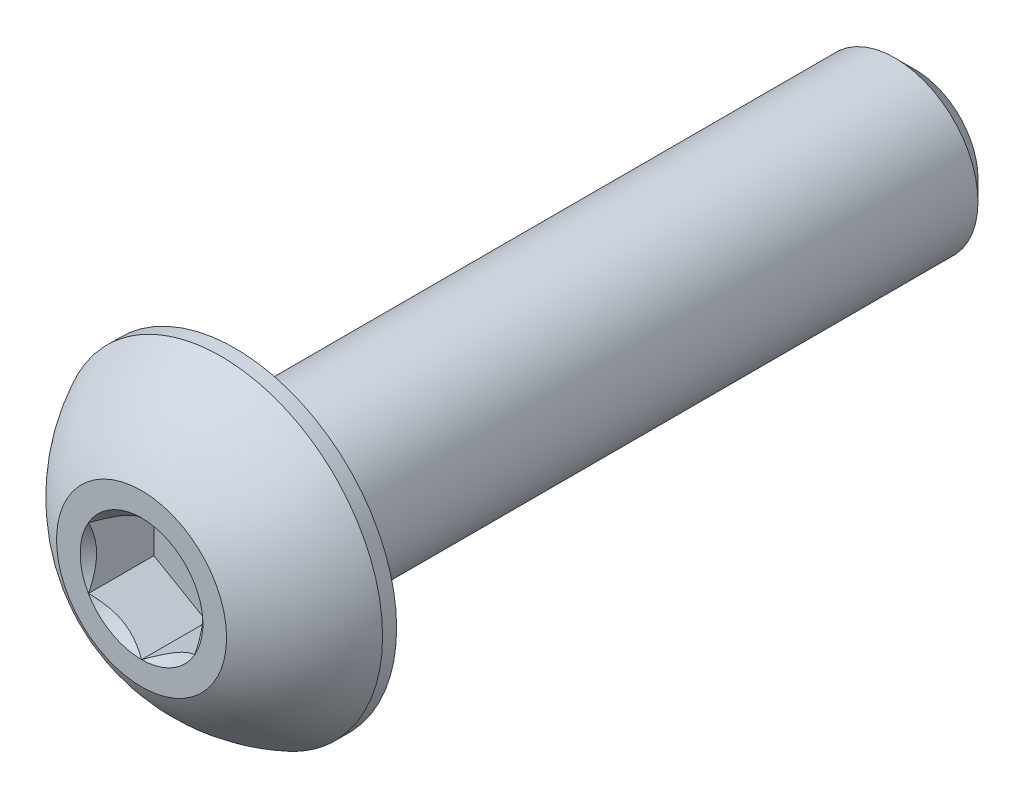
ISO-10303-21;
HEADER;
FILE_DESCRIPTION(('STEP AP214'),'2;1');
FILE_NAME('part.step','',(''),(''),'','','');
FILE_SCHEMA(('AUTOMOTIVE_DESIGN { 1 0 10303 214 1 1 1 1 }'));
ENDSEC;
DATA;
#1=APPLICATION_CONTEXT('core data for automotive mechanical design processes');
#2=APPLICATION_PROTOCOL_DEFINITION('international standard','automotive_design',2000,#1);
#3=PRODUCT_CONTEXT('',#1,'mechanical');
#4=PRODUCT('Part','Part','',(#3));
#5=PRODUCT_RELATED_PRODUCT_CATEGORY('part','',(#4));
#6=PRODUCT_DEFINITION_FORMATION('','',#4);
#7=PRODUCT_DEFINITION_CONTEXT('part definition',#1,'design');
#8=PRODUCT_DEFINITION('design','',#6,#7);
#9=PRODUCT_DEFINITION_SHAPE('','',#8);
#10=(LENGTH_UNIT() NAMED_UNIT(*) SI_UNIT(.MILLI.,.METRE.));
#11=(NAMED_UNIT(*) PLANE_ANGLE_UNIT() SI_UNIT($,.RADIAN.));
#12=(NAMED_UNIT(*) SI_UNIT($,.STERADIAN.) SOLID_ANGLE_UNIT());
#13=UNCERTAINTY_MEASURE_WITH_UNIT(LENGTH_MEASURE(1.E-05),#10,'distance_accuracy_value','');
#14=(GEOMETRIC_REPRESENTATION_CONTEXT(3) GLOBAL_UNCERTAINTY_ASSIGNED_CONTEXT((#13)) GLOBAL_UNIT_ASSIGNED_CONTEXT((#10,
#11,#12)) REPRESENTATION_CONTEXT('',''));
#15=CARTESIAN_POINT('',(0.,0.,0.));
#16=DIRECTION('',(0.,0.,1.));
#17=DIRECTION('',(1.,0.,0.));
#18=AXIS2_PLACEMENT_3D('',#15,#16,#17);
#19=CARTESIAN_POINT('',(1.25,-0.721687836487031,-1.54));
#20=DIRECTION('',(0.,0.,1.));
#21=DIRECTION('',(1.,0.,0.));
#22=AXIS2_PLACEMENT_3D('',#19,#20,#21);
#23=PLANE('',#22);
#24=DIRECTION('',(0.,1.,0.));
#25=VECTOR('',#24,1.);
#26=CARTESIAN_POINT('',(-1.25,0.721687836487031,-1.54));
#27=LINE('',#26,#25);
#28=CARTESIAN_POINT('',(-1.25,0.721687836487031,-1.54));
#29=VERTEX_POINT('',#28);
#30=CARTESIAN_POINT('',(-1.25,-0.721687836487033,-1.54));
#31=VERTEX_POINT('',#30);
#32=EDGE_CURVE('E67',#29,#31,#27,.F.);
#33=ORIENTED_EDGE('',*,*,#32,.T.);
#34=DIRECTION('',(0.866025403784439,-0.5,0.));
#35=VECTOR('',#34,1.);
#36=CARTESIAN_POINT('',(-1.25,-0.721687836487033,-1.54));
#37=LINE('',#36,#35);
#38=CARTESIAN_POINT('',(0.,-1.44337567297406,-1.54));
#39=VERTEX_POINT('',#38);
#40=EDGE_CURVE('E81',#31,#39,#37,.T.);
#41=ORIENTED_EDGE('',*,*,#40,.T.);
#42=DIRECTION('',(0.866025403784438,0.5,0.));
#43=VECTOR('',#42,1.);
#44=CARTESIAN_POINT('',(0.,-1.44337567297406,-1.54));
#45=LINE('',#44,#43);
#46=CARTESIAN_POINT('',(1.25,-0.721687836487033,-1.54));
#47=VERTEX_POINT('',#46);
#48=EDGE_CURVE('E84',#39,#47,#45,.T.);
#49=ORIENTED_EDGE('',*,*,#48,.T.);
#50=DIRECTION('',(0.,1.,0.));
#51=VECTOR('',#50,1.);
#52=CARTESIAN_POINT('',(1.25,-0.721687836487033,-1.54));
#53=LINE('',#52,#51);
#54=CARTESIAN_POINT('',(1.25,0.721687836487033,-1.54));
#55=VERTEX_POINT('',#54);
#56=EDGE_CURVE('E93',#47,#55,#53,.T.);
#57=ORIENTED_EDGE('',*,*,#56,.T.);
#58=DIRECTION('',(-0.866025403784439,0.5,0.));
#59=VECTOR('',#58,1.);
#60=CARTESIAN_POINT('',(1.25,0.721687836487033,-1.54));
#61=LINE('',#60,#59);
#62=CARTESIAN_POINT('',(0.,1.44337567297406,-1.54));
#63=VERTEX_POINT('',#62);
#64=EDGE_CURVE('E385',#55,#63,#61,.T.);
#65=ORIENTED_EDGE('',*,*,#64,.T.);
#66=DIRECTION('',(-0.866025403784438,-0.5,0.));
#67=VECTOR('',#66,1.);
#68=CARTESIAN_POINT('',(0.,1.44337567297406,-1.54));
#69=LINE('',#68,#67);
#70=EDGE_CURVE('E72',#63,#29,#69,.T.);
#71=ORIENTED_EDGE('',*,*,#70,.T.);
#72=EDGE_LOOP('',(#33,#41,#49,#57,#65,#71));
#73=FACE_BOUND('',#72,.T.);
#74=ADVANCED_FACE('F17',(#73),#23,.T.);
#75=CARTESIAN_POINT('',(-1.25,-0.721687836487033,-1.54));
#76=DIRECTION('',(-0.5,-0.866025403784439,0.));
#77=DIRECTION('',(0.866025403784439,-0.5,0.));
#78=AXIS2_PLACEMENT_3D('',#75,#76,#77);
#79=PLANE('',#78);
#80=CARTESIAN_POINT('',(-1.2500000000016,-0.721687836486112,-2.26680690502393E-12));
#81=CARTESIAN_POINT('',(-1.20703689150833,-0.746492598739922,-0.0247809602853243));
#82=CARTESIAN_POINT('',(-1.1633554359775,-0.77171209884924,-0.0481062505422091));
#83=CARTESIAN_POINT('',(-1.07428446548141,-0.823137247642139,-0.0908138610995832));
#84=CARTESIAN_POINT('',(-1.02888648449087,-0.849347784187694,-0.110172426663461));
#85=CARTESIAN_POINT('',(-0.937343688598988,-0.902200042038244,-0.143333784117163));
#86=CARTESIAN_POINT('',(-0.891222174228789,-0.928828310775312,-0.157219903251378));
#87=CARTESIAN_POINT('',(-0.797964038998481,-0.982670920254652,-0.178614098245693));
#88=CARTESIAN_POINT('',(-0.750830265050419,-1.00988361733149,-0.18613813813008));
#89=CARTESIAN_POINT('',(-0.669590913661114,-1.05678717872489,-0.19292717226635));
#90=CARTESIAN_POINT('',(-0.6355901781368,-1.0764175125325,-0.193931811413058));
#91=CARTESIAN_POINT('',(-0.567648554853577,-1.11564362702425,-0.192236504858617));
#92=CARTESIAN_POINT('',(-0.533707681972965,-1.1352393991184,-0.189535740825173));
#93=CARTESIAN_POINT('',(-0.466153619951156,-1.17424175501155,-0.180585751756809));
#94=CARTESIAN_POINT('',(-0.432540765124884,-1.19364814579373,-0.174333227052607));
#95=CARTESIAN_POINT('',(-0.365876261008733,-1.23213691519058,-0.158616460881212));
#96=CARTESIAN_POINT('',(-0.332824858931062,-1.25121915107722,-0.149150841277127));
#97=CARTESIAN_POINT('',(-0.24821357015969,-1.30006950142585,-0.121071668556234));
#98=CARTESIAN_POINT('',(-0.197186124607518,-1.32953021085146,-0.1003506550557));
#99=CARTESIAN_POINT('',(-0.0971276057052182,-1.38729902367441,-0.0536764942537936));
#100=CARTESIAN_POINT('',(-0.0480906425773469,-1.41561052753653,-0.0277403788128102));
#101=CARTESIAN_POINT('',(1.59502018373781E-12,-1.44337567297499,-2.26719487247284E-12));
#102=B_SPLINE_CURVE_WITH_KNOTS('',3,(#80,#81,#82,#83,#84,#85,#86,#87,#88,#89,#90,#91,#92,#93,
#94,#95,#96,#97,#98,#99,#100,#101),.UNSPECIFIED.,.F.,.F.,(4,2,2,2,2,2,2,2,2,2,4),(0.,
0.166478683193946,0.333926926769032,0.498716658424013,0.663091654503517,0.780745575390527,
0.89842548413854,1.01621489951224,1.13405490022132,1.3211159162831,1.5075756576265),.UNSPECIFIED.);
#103=CARTESIAN_POINT('',(-1.25000000000138,-0.72168783648783,-1.59398549547677E-12));
#104=VERTEX_POINT('',#103);
#105=CARTESIAN_POINT('',(-1.96480456724534E-12,-1.44337567297612,-1.13358815723702E-12));
#106=VERTEX_POINT('',#105);
#107=EDGE_CURVE('E20',#104,#106,#102,.T.);
#108=ORIENTED_EDGE('',*,*,#107,.T.);
#109=DIRECTION('',(0.,0.,1.));
#110=VECTOR('',#109,1.);
#111=CARTESIAN_POINT('',(0.,-1.44337567297406,-1.54));
#112=LINE('',#111,#110);
#113=EDGE_CURVE('E88',#106,#39,#112,.F.);
#114=ORIENTED_EDGE('',*,*,#113,.T.);
#115=ORIENTED_EDGE('',*,*,#40,.F.);
#116=DIRECTION('',(0.,0.,1.));
#117=VECTOR('',#116,1.);
#118=CARTESIAN_POINT('',(-1.25,-0.721687836487033,-1.54));
#119=LINE('',#118,#117);
#120=EDGE_CURVE('E59',#31,#104,#119,.T.);
#121=ORIENTED_EDGE('',*,*,#120,.T.);
#122=EDGE_LOOP('',(#108,#114,#115,#121));
#123=FACE_BOUND('',#122,.T.);
#124=ADVANCED_FACE('F89',(#123),#79,.F.);
#125=CARTESIAN_POINT('',(0.,-1.44337567297406,-1.54));
#126=DIRECTION('',(0.5,-0.866025403784438,0.));
#127=DIRECTION('',(0.866025403784438,0.5,0.));
#128=AXIS2_PLACEMENT_3D('',#125,#126,#127);
#129=PLANE('',#128);
#130=CARTESIAN_POINT('',(-1.59593960180263E-12,-1.44337567297499,-2.26827482999804E-12));
#131=CARTESIAN_POINT('',(0.0429631084916689,-1.41857091072118,-0.024780960285326));
#132=CARTESIAN_POINT('',(0.0866445640224967,-1.39335141061186,-0.0481062505422108));
#133=CARTESIAN_POINT('',(0.175715534518587,-1.34192626181896,-0.0908138610995848));
#134=CARTESIAN_POINT('',(0.22111351550913,-1.3157157252734,-0.110172426663462));
#135=CARTESIAN_POINT('',(0.312656311401013,-1.26286346742285,-0.143333784117164));
#136=CARTESIAN_POINT('',(0.358777825771212,-1.23623519868579,-0.15721990325138));
#137=CARTESIAN_POINT('',(0.45203596100152,-1.18239258920645,-0.178614098245694));
#138=CARTESIAN_POINT('',(0.499169734949581,-1.15517989212961,-0.186138138130082));
#139=CARTESIAN_POINT('',(0.580409086338886,-1.1082763307362,-0.192927172266352));
#140=CARTESIAN_POINT('',(0.6144098218632,-1.0886459969286,-0.19393181141306));
#141=CARTESIAN_POINT('',(0.682351445146423,-1.04941988243685,-0.192236504858619));
#142=CARTESIAN_POINT('',(0.716292318027036,-1.02982411034269,-0.189535740825175));
#143=CARTESIAN_POINT('',(0.783846380048844,-0.99082175444955,-0.180585751756811));
#144=CARTESIAN_POINT('',(0.817459234875116,-0.97141536366737,-0.174333227052609));
#145=CARTESIAN_POINT('',(0.884123738991267,-0.932926594270518,-0.158616460881214));
#146=CARTESIAN_POINT('',(0.917175141068938,-0.91384435838388,-0.149150841277129));
#147=CARTESIAN_POINT('',(1.00178642984031,-0.864994008035247,-0.121071668556236));
#148=CARTESIAN_POINT('',(1.05281387539248,-0.835533298609641,-0.100350655055702));
#149=CARTESIAN_POINT('',(1.15287239429478,-0.777764485786683,-0.0536764942537957));
#150=CARTESIAN_POINT('',(1.20190935742265,-0.749452981924565,-0.0277403788128122));
#151=CARTESIAN_POINT('',(1.25000000000159,-0.721687836486111,-2.26918539268348E-12));
#152=B_SPLINE_CURVE_WITH_KNOTS('',3,(#130,#131,#132,#133,#134,#135,#136,#137,#138,#139,#140,
#141,#142,#143,#144,#145,#146,#147,#148,#149,#150,#151),.UNSPECIFIED.,.F.,.F.,(4,2,2,2,2,2,2,2,
2,2,4),(0.,0.166478683193946,0.333926926769032,0.498716658424014,0.663091654503517,
0.780745575390527,0.89842548413854,1.01621489951224,1.13405490022132,1.32111591628309,
1.5075756576265),.UNSPECIFIED.);
#153=CARTESIAN_POINT('',(1.2500000000008,-0.721687836489762,-1.13470960474945E-12));
#154=VERTEX_POINT('',#153);
#155=EDGE_CURVE('E202',#106,#154,#152,.T.);
#156=ORIENTED_EDGE('',*,*,#155,.T.);
#157=DIRECTION('',(0.,0.,1.));
#158=VECTOR('',#157,1.);
#159=CARTESIAN_POINT('',(1.25,-0.721687836487033,-1.54));
#160=LINE('',#159,#158);
#161=EDGE_CURVE('E97',#154,#47,#160,.F.);
#162=ORIENTED_EDGE('',*,*,#161,.T.);
#163=ORIENTED_EDGE('',*,*,#48,.F.);
#164=ORIENTED_EDGE('',*,*,#113,.F.);
#165=EDGE_LOOP('',(#156,#162,#163,#164));
#166=FACE_BOUND('',#165,.T.);
#167=ADVANCED_FACE('F95',(#166),#129,.F.);
#168=CARTESIAN_POINT('',(1.25,-0.721687836487033,-1.54));
#169=DIRECTION('',(1.,0.,0.));
#170=DIRECTION('',(0.,1.,0.));
#171=AXIS2_PLACEMENT_3D('',#168,#169,#170);
#172=PLANE('',#171);
#173=CARTESIAN_POINT('',(1.25,-0.721687836488877,-2.26858313223581E-12));
#174=CARTESIAN_POINT('',(1.25,-0.672078311968736,-0.0247809602843532));
#175=CARTESIAN_POINT('',(1.25,-0.621639311737502,-0.0481062505397492));
#176=CARTESIAN_POINT('',(1.25,-0.51878901412652,-0.0908138610927579));
#177=CARTESIAN_POINT('',(1.25,-0.466367941022825,-0.110172426653756));
#178=CARTESIAN_POINT('',(1.25,-0.360663425297223,-0.143333784099998));
#179=CARTESIAN_POINT('',(1.25,-0.307406887811173,-0.157219903229684));
#180=CARTESIAN_POINT('',(1.25,-0.199721668829271,-0.178614098213363));
#181=CARTESIAN_POINT('',(1.25,-0.145296274664292,-0.186138138091648));
#182=CARTESIAN_POINT('',(1.25,-0.0514891518512719,-0.19292717221706));
#183=CARTESIAN_POINT('',(1.25,-0.012228484220886,-0.193931811358573));
#184=CARTESIAN_POINT('',(1.25,0.0662237447923827,-0.192236504792063));
#185=CARTESIAN_POINT('',(1.25,0.105415288995289,-0.189535740751744));
#186=CARTESIAN_POINT('',(1.25,0.183420000810114,-0.180585751668418));
#187=CARTESIAN_POINT('',(1.25,0.222232782388409,-0.174333226956126));
#188=CARTESIAN_POINT('',(1.25,0.299210321209359,-0.158616460767835));
#189=CARTESIAN_POINT('',(1.25,0.337374792995944,-0.149150841154943));
#190=CARTESIAN_POINT('',(1.25,0.435075493649189,-0.121071668433229));
#191=CARTESIAN_POINT('',(1.25,0.493996912445358,-0.100350654949519));
#192=CARTESIAN_POINT('',(1.25,0.609534537985814,-0.0536764941931696));
#193=CARTESIAN_POINT('',(1.25,0.666157545659632,-0.0277403787809145));
#194=CARTESIAN_POINT('',(1.25,0.721687836488876,-2.26852855574465E-12));
#195=B_SPLINE_CURVE_WITH_KNOTS('',3,(#173,#174,#175,#176,#177,#178,#179,#180,#181,#182,#183,
#184,#185,#186,#187,#188,#189,#190,#191,#192,#193,#194),.UNSPECIFIED.,.F.,.F.,(4,2,2,2,2,2,2,2,
2,2,4),(0.,0.166478683226287,0.333926926833724,0.498716658519757,0.663091654630287,
0.780745575562285,0.898425484355341,1.01621489977414,1.13405490052833,1.3211159164188,
1.50757565759032),.UNSPECIFIED.);
#196=CARTESIAN_POINT('',(1.25000000000276,0.72168783648636,-1.13427785673266E-12));
#197=VERTEX_POINT('',#196);
#198=EDGE_CURVE('E184',#154,#197,#195,.T.);
#199=ORIENTED_EDGE('',*,*,#198,.T.);
#200=DIRECTION('',(0.,0.,1.));
#201=VECTOR('',#200,1.);
#202=CARTESIAN_POINT('',(1.25,0.721687836487033,-1.54));
#203=LINE('',#202,#201);
#204=EDGE_CURVE('E378',#197,#55,#203,.F.);
#205=ORIENTED_EDGE('',*,*,#204,.T.);
#206=ORIENTED_EDGE('',*,*,#56,.F.);
#207=ORIENTED_EDGE('',*,*,#161,.F.);
#208=EDGE_LOOP('',(#199,#205,#206,#207));
#209=FACE_BOUND('',#208,.T.);
#210=ADVANCED_FACE('F174',(#209),#172,.F.);
#211=CARTESIAN_POINT('',(1.25,0.721687836487033,-1.54));
#212=DIRECTION('',(0.5,0.866025403784439,0.));
#213=DIRECTION('',(-0.866025403784439,0.5,0.));
#214=AXIS2_PLACEMENT_3D('',#211,#212,#213);
#215=PLANE('',#214);
#216=CARTESIAN_POINT('',(1.2500000000016,0.721687836486112,-2.26852689436779E-12));
#217=CARTESIAN_POINT('',(1.20703689150833,0.746492598739921,-0.0247809602853261));
#218=CARTESIAN_POINT('',(1.1633554359775,0.771712098849239,-0.0481062505422108));
#219=CARTESIAN_POINT('',(1.07428446548141,0.823137247642138,-0.0908138610995846));
#220=CARTESIAN_POINT('',(1.02888648449087,0.849347784187693,-0.110172426663462));
#221=CARTESIAN_POINT('',(0.937343688598987,0.902200042038243,-0.143333784117164));
#222=CARTESIAN_POINT('',(0.891222174228788,0.92882831077531,-0.15721990325138));
#223=CARTESIAN_POINT('',(0.79796403899848,0.982670920254651,-0.178614098245694));
#224=CARTESIAN_POINT('',(0.750830265050419,1.00988361733149,-0.186138138130081));
#225=CARTESIAN_POINT('',(0.669590913661114,1.05678717872489,-0.192927172266351));
#226=CARTESIAN_POINT('',(0.6355901781368,1.0764175125325,-0.19393181141306));
#227=CARTESIAN_POINT('',(0.567648554853577,1.11564362702425,-0.192236504858619));
#228=CARTESIAN_POINT('',(0.533707681972964,1.1352393991184,-0.189535740825174));
#229=CARTESIAN_POINT('',(0.466153619951156,1.17424175501155,-0.180585751756811));
#230=CARTESIAN_POINT('',(0.432540765124883,1.19364814579373,-0.174333227052609));
#231=CARTESIAN_POINT('',(0.365876261008733,1.23213691519058,-0.158616460881213));
#232=CARTESIAN_POINT('',(0.332824858931062,1.25121915107722,-0.149150841277128));
#233=CARTESIAN_POINT('',(0.24821357015969,1.30006950142585,-0.121071668556235));
#234=CARTESIAN_POINT('',(0.197186124607517,1.32953021085146,-0.100350655055702));
#235=CARTESIAN_POINT('',(0.0971276057052174,1.38729902367441,-0.0536764942537946));
#236=CARTESIAN_POINT('',(0.0480906425773461,1.41561052753653,-0.0277403788128111));
#237=CARTESIAN_POINT('',(-1.59614565415006E-12,1.44337567297499,-2.26815881940463E-12));
#238=B_SPLINE_CURVE_WITH_KNOTS('',3,(#216,#217,#218,#219,#220,#221,#222,#223,#224,#225,#226,
#227,#228,#229,#230,#231,#232,#233,#234,#235,#236,#237),.UNSPECIFIED.,.F.,.F.,(4,2,2,2,2,2,2,2,
2,2,4),(0.,0.166478683193945,0.333926926769031,0.498716658424013,0.663091654503516,
0.780745575390525,0.898425484138539,1.01621489951224,1.13405490022132,1.32111591628309,
1.5075756576265),.UNSPECIFIED.);
#239=CARTESIAN_POINT('',(1.96420839553081E-12,1.44337567297612,-1.13406793319909E-12));
#240=VERTEX_POINT('',#239);
#241=EDGE_CURVE('E178',#197,#240,#238,.T.);
#242=ORIENTED_EDGE('',*,*,#241,.T.);
#243=DIRECTION('',(0.,0.,1.));
#244=VECTOR('',#243,1.);
#245=CARTESIAN_POINT('',(0.,1.44337567297406,-1.54));
#246=LINE('',#245,#244);
#247=EDGE_CURVE('E413',#240,#63,#246,.F.);
#248=ORIENTED_EDGE('',*,*,#247,.T.);
#249=ORIENTED_EDGE('',*,*,#64,.F.);
#250=ORIENTED_EDGE('',*,*,#204,.F.);
#251=EDGE_LOOP('',(#242,#248,#249,#250));
#252=FACE_BOUND('',#251,.T.);
#253=ADVANCED_FACE('F170',(#252),#215,.F.);
#254=CARTESIAN_POINT('',(0.,1.44337567297406,-1.54));
#255=DIRECTION('',(-0.5,0.866025403784438,0.));
#256=DIRECTION('',(-0.866025403784438,-0.5,0.));
#257=AXIS2_PLACEMENT_3D('',#254,#255,#256);
#258=PLANE('',#257);
#259=CARTESIAN_POINT('',(1.59588788817423E-12,1.44337567297499,-2.26830309245758E-12));
#260=CARTESIAN_POINT('',(-0.0429631084916689,1.41857091072118,-0.024780960285326));
#261=CARTESIAN_POINT('',(-0.0866445640224966,1.39335141061186,-0.0481062505422108));
#262=CARTESIAN_POINT('',(-0.175715534518587,1.34192626181896,-0.0908138610995847));
#263=CARTESIAN_POINT('',(-0.22111351550913,1.3157157252734,-0.110172426663462));
#264=CARTESIAN_POINT('',(-0.312656311401013,1.26286346742285,-0.143333784117164));
#265=CARTESIAN_POINT('',(-0.358777825771212,1.23623519868579,-0.15721990325138));
#266=CARTESIAN_POINT('',(-0.45203596100152,1.18239258920645,-0.178614098245694));
#267=CARTESIAN_POINT('',(-0.499169734949581,1.15517989212961,-0.186138138130082));
#268=CARTESIAN_POINT('',(-0.580409086338886,1.1082763307362,-0.192927172266352));
#269=CARTESIAN_POINT('',(-0.6144098218632,1.0886459969286,-0.19393181141306));
#270=CARTESIAN_POINT('',(-0.682351445146423,1.04941988243685,-0.192236504858619));
#271=CARTESIAN_POINT('',(-0.716292318027036,1.02982411034269,-0.189535740825175));
#272=CARTESIAN_POINT('',(-0.783846380048844,0.99082175444955,-0.180585751756811));
#273=CARTESIAN_POINT('',(-0.817459234875116,0.97141536366737,-0.174333227052609));
#274=CARTESIAN_POINT('',(-0.884123738991267,0.932926594270518,-0.158616460881214));
#275=CARTESIAN_POINT('',(-0.917175141068938,0.91384435838388,-0.149150841277129));
#276=CARTESIAN_POINT('',(-1.00178642984031,0.864994008035247,-0.121071668556236));
#277=CARTESIAN_POINT('',(-1.05281387539248,0.835533298609641,-0.100350655055702));
#278=CARTESIAN_POINT('',(-1.15287239429478,0.777764485786682,-0.053676494253795));
#279=CARTESIAN_POINT('',(-1.20190935742265,0.749452981924564,-0.0277403788128114));
#280=CARTESIAN_POINT('',(-1.2500000000016,0.721687836486109,-2.26808265388969E-12));
#281=B_SPLINE_CURVE_WITH_KNOTS('',3,(#259,#260,#261,#262,#263,#264,#265,#266,#267,#268,#269,
#270,#271,#272,#273,#274,#275,#276,#277,#278,#279,#280),.UNSPECIFIED.,.F.,.F.,(4,2,2,2,2,2,2,2,
2,2,4),(0.,0.166478683193945,0.333926926769032,0.498716658424013,0.663091654503517,
0.780745575390527,0.89842548413854,1.01621489951224,1.13405490022132,1.3211159162831,
1.5075756576265),.UNSPECIFIED.);
#282=CARTESIAN_POINT('',(-1.2500000000008,0.721687836489759,-1.13401309289731E-12));
#283=VERTEX_POINT('',#282);
#284=EDGE_CURVE('E40',#240,#283,#281,.T.);
#285=ORIENTED_EDGE('',*,*,#284,.T.);
#286=DIRECTION('',(0.,0.,1.));
#287=VECTOR('',#286,1.);
#288=CARTESIAN_POINT('',(-1.25,0.721687836487031,-1.54));
#289=LINE('',#288,#287);
#290=EDGE_CURVE('E403',#283,#29,#289,.F.);
#291=ORIENTED_EDGE('',*,*,#290,.T.);
#292=ORIENTED_EDGE('',*,*,#70,.F.);
#293=ORIENTED_EDGE('',*,*,#247,.F.);
#294=EDGE_LOOP('',(#285,#291,#292,#293));
#295=FACE_BOUND('',#294,.T.);
#296=ADVANCED_FACE('F163',(#295),#258,.F.);
#297=CARTESIAN_POINT('',(-1.25,0.721687836487031,-1.54));
#298=DIRECTION('',(-1.,0.,0.));
#299=DIRECTION('',(0.,0.,1.));
#300=AXIS2_PLACEMENT_3D('',#297,#298,#299);
#301=PLANE('',#300);
#302=CARTESIAN_POINT('',(-1.25,0.721687836488873,-2.26776707094958E-12));
#303=CARTESIAN_POINT('',(-1.25,0.672078311968733,-0.0247809602843521));
#304=CARTESIAN_POINT('',(-1.25,0.621639311737499,-0.0481062505397479));
#305=CARTESIAN_POINT('',(-1.25,0.518789014126517,-0.0908138610927563));
#306=CARTESIAN_POINT('',(-1.25,0.466367941022822,-0.110172426653754));
#307=CARTESIAN_POINT('',(-1.25,0.36066342529722,-0.143333784099995));
#308=CARTESIAN_POINT('',(-1.25,0.307406887811171,-0.157219903229682));
#309=CARTESIAN_POINT('',(-1.25,0.19972166882927,-0.178614098213361));
#310=CARTESIAN_POINT('',(-1.25,0.145296274664291,-0.186138138091645));
#311=CARTESIAN_POINT('',(-1.25,0.0514891518512707,-0.192927172217058));
#312=CARTESIAN_POINT('',(-1.25,0.0122284842208847,-0.19393181135857));
#313=CARTESIAN_POINT('',(-1.25,-0.0662237447923841,-0.19223650479206));
#314=CARTESIAN_POINT('',(-1.25,-0.10541528899529,-0.189535740751741));
#315=CARTESIAN_POINT('',(-1.25,-0.183420000810115,-0.180585751668415));
#316=CARTESIAN_POINT('',(-1.25,-0.222232782388411,-0.174333226956124));
#317=CARTESIAN_POINT('',(-1.25,-0.299210321209361,-0.158616460767832));
#318=CARTESIAN_POINT('',(-1.25,-0.337374792995946,-0.14915084115494));
#319=CARTESIAN_POINT('',(-1.25,-0.435075493649191,-0.121071668433226));
#320=CARTESIAN_POINT('',(-1.25,-0.493996912445359,-0.100350654949516));
#321=CARTESIAN_POINT('',(-1.25,-0.609534537985814,-0.0536764941931675));
#322=CARTESIAN_POINT('',(-1.25,-0.666157545659631,-0.0277403787809127));
#323=CARTESIAN_POINT('',(-1.25,-0.721687836488875,-2.26701206431143E-12));
#324=B_SPLINE_CURVE_WITH_KNOTS('',3,(#302,#303,#304,#305,#306,#307,#308,#309,#310,#311,#312,
#313,#314,#315,#316,#317,#318,#319,#320,#321,#322,#323),.UNSPECIFIED.,.F.,.F.,(4,2,2,2,2,2,2,2,
2,2,4),(0.,0.166478683226286,0.333926926833723,0.498716658519755,0.663091654630284,
0.780745575562283,0.898425484355339,1.01621489977414,1.13405490052833,1.3211159164188,
1.50757565759031),.UNSPECIFIED.);
#325=EDGE_CURVE('E143',#283,#104,#324,.T.);
#326=ORIENTED_EDGE('',*,*,#325,.T.);
#327=ORIENTED_EDGE('',*,*,#120,.F.);
#328=ORIENTED_EDGE('',*,*,#32,.F.);
#329=ORIENTED_EDGE('',*,*,#290,.F.);
#330=EDGE_LOOP('',(#326,#327,#328,#329));
#331=FACE_BOUND('',#330,.T.);
#332=ADVANCED_FACE('F159',(#331),#301,.F.);
#333=CARTESIAN_POINT('',(0.,0.,-5.6843418860808E-11));
#334=DIRECTION('',(0.,0.,1.));
#335=DIRECTION('',(1.,0.,0.));
#336=AXIS2_PLACEMENT_3D('',#333,#334,#335);
#337=CONICAL_SURFACE('',#336,1.44337567292041,0.78539816325135);
#338=ORIENTED_EDGE('',*,*,#107,.F.);
#339=CARTESIAN_POINT('',(0.,0.,0.));
#340=DIRECTION('',(0.,0.,1.));
#341=DIRECTION('',(1.,0.,0.));
#342=AXIS2_PLACEMENT_3D('',#339,#340,#341);
#343=CIRCLE('',#342,1.44337567297725);
#344=EDGE_CURVE('E151',#104,#106,#343,.T.);
#345=ORIENTED_EDGE('',*,*,#344,.T.);
#346=EDGE_LOOP('',(#338,#345));
#347=FACE_BOUND('',#346,.T.);
#348=ADVANCED_FACE('F162',(#347),#337,.F.);
#349=CARTESIAN_POINT('',(0.,0.,-5.6843418860808E-11));
#350=DIRECTION('',(0.,0.,1.));
#351=DIRECTION('',(1.,0.,0.));
#352=AXIS2_PLACEMENT_3D('',#349,#350,#351);
#353=CONICAL_SURFACE('',#352,1.44337567292041,0.78539816325135);
#354=ORIENTED_EDGE('',*,*,#155,.F.);
#355=CARTESIAN_POINT('',(0.,0.,0.));
#356=DIRECTION('',(0.,0.,1.));
#357=DIRECTION('',(1.,0.,0.));
#358=AXIS2_PLACEMENT_3D('',#355,#356,#357);
#359=CIRCLE('',#358,1.44337567297725);
#360=EDGE_CURVE('E391',#106,#154,#359,.T.);
#361=ORIENTED_EDGE('',*,*,#360,.T.);
#362=EDGE_LOOP('',(#354,#361));
#363=FACE_BOUND('',#362,.T.);
#364=ADVANCED_FACE('F197',(#363),#353,.F.);
#365=CARTESIAN_POINT('',(0.,0.,-5.6843418860808E-11));
#366=DIRECTION('',(0.,0.,1.));
#367=DIRECTION('',(1.,0.,0.));
#368=AXIS2_PLACEMENT_3D('',#365,#366,#367);
#369=CONICAL_SURFACE('',#368,1.44337567292041,0.785398163397448);
#370=CARTESIAN_POINT('',(0.,0.,0.));
#371=DIRECTION('',(0.,0.,1.));
#372=DIRECTION('',(1.,0.,0.));
#373=AXIS2_PLACEMENT_3D('',#370,#371,#372);
#374=CIRCLE('',#373,1.44337567297725);
#375=EDGE_CURVE('E387',#154,#197,#374,.T.);
#376=ORIENTED_EDGE('',*,*,#375,.T.);
#377=ORIENTED_EDGE('',*,*,#198,.F.);
#378=EDGE_LOOP('',(#376,#377));
#379=FACE_BOUND('',#378,.T.);
#380=ADVANCED_FACE('F193',(#379),#369,.F.);
#381=CARTESIAN_POINT('',(0.,0.,-5.6843418860808E-11));
#382=DIRECTION('',(0.,0.,1.));
#383=DIRECTION('',(1.,0.,0.));
#384=AXIS2_PLACEMENT_3D('',#381,#382,#383);
#385=CONICAL_SURFACE('',#384,1.44337567292041,0.78539816325135);
#386=ORIENTED_EDGE('',*,*,#241,.F.);
#387=CARTESIAN_POINT('',(0.,0.,0.));
#388=DIRECTION('',(0.,0.,1.));
#389=DIRECTION('',(1.,0.,0.));
#390=AXIS2_PLACEMENT_3D('',#387,#388,#389);
#391=CIRCLE('',#390,1.44337567297725);
#392=EDGE_CURVE('E390',#197,#240,#391,.T.);
#393=ORIENTED_EDGE('',*,*,#392,.T.);
#394=EDGE_LOOP('',(#386,#393));
#395=FACE_BOUND('',#394,.T.);
#396=ADVANCED_FACE('F190',(#395),#385,.F.);
#397=CARTESIAN_POINT('',(0.,0.,-5.6843418860808E-11));
#398=DIRECTION('',(0.,0.,1.));
#399=DIRECTION('',(1.,0.,0.));
#400=AXIS2_PLACEMENT_3D('',#397,#398,#399);
#401=CONICAL_SURFACE('',#400,1.44337567292041,0.78539816325135);
#402=ORIENTED_EDGE('',*,*,#284,.F.);
#403=CARTESIAN_POINT('',(0.,0.,0.));
#404=DIRECTION('',(0.,0.,1.));
#405=DIRECTION('',(1.,0.,0.));
#406=AXIS2_PLACEMENT_3D('',#403,#404,#405);
#407=CIRCLE('',#406,1.44337567297725);
#408=EDGE_CURVE('E397',#240,#283,#407,.T.);
#409=ORIENTED_EDGE('',*,*,#408,.T.);
#410=EDGE_LOOP('',(#402,#409));
#411=FACE_BOUND('',#410,.T.);
#412=ADVANCED_FACE('F138',(#411),#401,.F.);
#413=CARTESIAN_POINT('',(0.,0.,-5.6843418860808E-11));
#414=DIRECTION('',(0.,0.,1.));
#415=DIRECTION('',(1.,0.,0.));
#416=AXIS2_PLACEMENT_3D('',#413,#414,#415);
#417=CONICAL_SURFACE('',#416,1.44337567292041,0.785398163397448);
#418=ORIENTED_EDGE('',*,*,#325,.F.);
#419=CARTESIAN_POINT('',(0.,0.,0.));
#420=DIRECTION('',(0.,0.,1.));
#421=DIRECTION('',(1.,0.,0.));
#422=AXIS2_PLACEMENT_3D('',#419,#420,#421);
#423=CIRCLE('',#422,1.44337567297725);
#424=EDGE_CURVE('E123',#283,#104,#423,.T.);
#425=ORIENTED_EDGE('',*,*,#424,.T.);
#426=EDGE_LOOP('',(#418,#425));
#427=FACE_BOUND('',#426,.T.);
#428=ADVANCED_FACE('F133',(#427),#417,.F.);
#429=CARTESIAN_POINT('',(0.,-2.,0.));
#430=DIRECTION('',(0.,0.,-1.));
#431=DIRECTION('',(-1.,0.,0.));
#432=AXIS2_PLACEMENT_3D('',#429,#430,#431);
#433=PLANE('',#432);
#434=ORIENTED_EDGE('',*,*,#408,.F.);
#435=ORIENTED_EDGE('',*,*,#392,.F.);
#436=ORIENTED_EDGE('',*,*,#375,.F.);
#437=ORIENTED_EDGE('',*,*,#360,.F.);
#438=ORIENTED_EDGE('',*,*,#344,.F.);
#439=ORIENTED_EDGE('',*,*,#424,.F.);
#440=EDGE_LOOP('',(#434,#435,#436,#437,#438,#439));
#441=FACE_BOUND('',#440,.T.);
#442=CARTESIAN_POINT('',(0.,2.00000000000003,0.));
#443=CARTESIAN_POINT('',(-0.112340883932912,1.99999501830894,0.));
#444=CARTESIAN_POINT('',(-0.224763225593511,1.99050288387286,2.67786643744105E-13));
#445=CARTESIAN_POINT('',(-0.446511726793884,1.95276859922381,-2.68543076346947E-13));
#446=CARTESIAN_POINT('',(-0.555833994612163,1.92450388247341,-1.01747290029802E-12));
#447=CARTESIAN_POINT('',(-0.768137698049019,1.85002906418696,-9.04627644213959E-13));
#448=CARTESIAN_POINT('',(-0.871122134819581,1.80382753320625,0.));
#449=CARTESIAN_POINT('',(-1.06784380972382,1.69480235085557,0.));
#450=CARTESIAN_POINT('',(-1.16158333928641,1.63198283268137,-7.30626007281602E-13));
#451=CARTESIAN_POINT('',(-1.33719709830383,1.49149220719559,-8.68796266313718E-13));
#452=CARTESIAN_POINT('',(-1.4190700851378,1.41381954648976,-2.33016417267554E-13));
#453=CARTESIAN_POINT('',(-1.56861687177601,1.24582829627509,2.32591876319973E-13));
#454=CARTESIAN_POINT('',(-1.63629011398115,1.15550921039541,0.));
#455=CARTESIAN_POINT('',(-1.75551140838453,0.964793228617706,0.));
#456=CARTESIAN_POINT('',(-1.80705976087959,0.864396520443123,0.));
#457=CARTESIAN_POINT('',(-1.89256952340776,0.656374060165251,0.));
#458=CARTESIAN_POINT('',(-1.92653096880464,0.548748322598588,0.));
#459=CARTESIAN_POINT('',(-1.97590307610692,0.329322588612884,0.));
#460=CARTESIAN_POINT('',(-1.99131370264779,0.217522584236606,0.));
#461=CARTESIAN_POINT('',(-2.00314657525842,-0.00707760750866588,0.));
#462=CARTESIAN_POINT('',(-1.9995688555433,-0.119877793075068,0.));
#463=CARTESIAN_POINT('',(-1.97352667238585,-0.343276528884571,0.));
#464=CARTESIAN_POINT('',(-1.951062201896,-0.453875078306125,0.));
#465=CARTESIAN_POINT('',(-1.88788417341464,-0.66973104818561,0.));
#466=CARTESIAN_POINT('',(-1.84717059615924,-0.774988463005274,0.));
#467=CARTESIAN_POINT('',(-1.74865010522098,-0.97717405329449,0.));
#468=CARTESIAN_POINT('',(-1.69084319710066,-1.07410223147454,0.));
#469=CARTESIAN_POINT('',(-1.55977703496568,-1.25687784284644,0.));
#470=CARTESIAN_POINT('',(-1.48651778720563,-1.34272528052339,0.));
#471=CARTESIAN_POINT('',(-1.32662653450798,-1.50090251249224,0.));
#472=CARTESIAN_POINT('',(-1.23999452773777,-1.57323230493167,0.));
#473=CARTESIAN_POINT('',(-1.05581697990551,-1.70232101036838,0.));
#474=CARTESIAN_POINT('',(-0.958271437417266,-1.75907992133083,0.));
#475=CARTESIAN_POINT('',(-0.755035863250462,-1.85541563039962,0.));
#476=CARTESIAN_POINT('',(-0.649345831920623,-1.89499242924164,0.));
#477=CARTESIAN_POINT('',(-0.432821510670029,-1.95584044724505,0.));
#478=CARTESIAN_POINT('',(-0.321987220981026,-1.97711166723113,0.));
#479=CARTESIAN_POINT('',(-0.0983206380605815,-2.000744703181,0.));
#480=CARTESIAN_POINT('',(0.0145116551708587,-2.00310651914481,2.77400188876239E-13));
#481=CARTESIAN_POINT('',(0.238971273328264,-1.98885370171912,-2.77833882252049E-13));
#482=CARTESIAN_POINT('',(0.350598598199945,-1.9722390674747,-1.03613454444918E-12));
#483=CARTESIAN_POINT('',(0.569479507471842,-1.92050498775072,-9.10225192901255E-13));
#484=CARTESIAN_POINT('',(0.676733091684786,-1.88538554147883,0.));
#485=CARTESIAN_POINT('',(0.883821886677256,-1.79763878093746,0.));
#486=CARTESIAN_POINT('',(0.983657098426234,-1.74501146895597,-8.07031901708265E-13));
#487=CARTESIAN_POINT('',(1.17307512321431,-1.6237429186722,-9.46773522929174E-13));
#488=CARTESIAN_POINT('',(1.26265793765839,-1.55510168256446,-2.53902026906535E-13));
#489=CARTESIAN_POINT('',(1.42902822576514,-1.40375377143034,2.5346844872083E-13));
#490=CARTESIAN_POINT('',(1.50581569424866,-1.32104709071074,0.));
#491=CARTESIAN_POINT('',(1.6444154975537,-1.143916081062,0.));
#492=CARTESIAN_POINT('',(1.706227827502,-1.04949174831972,0.));
#493=CARTESIAN_POINT('',(1.81312259248707,-0.851605992808604,0.));
#494=CARTESIAN_POINT('',(1.85820504518398,-0.748144579579494,0.));
#495=CARTESIAN_POINT('',(1.930360377799,-0.535121579788187,0.));
#496=CARTESIAN_POINT('',(1.95743326443731,-0.425559995502262,0.));
#497=CARTESIAN_POINT('',(1.99280100395237,-0.203446542492708,0.));
#498=CARTESIAN_POINT('',(2.00109582299283,-0.090894668381231,0.));
#499=CARTESIAN_POINT('',(1.99867186914421,0.134003935799385,0.));
#500=CARTESIAN_POINT('',(1.98795313250174,0.246350666259192,0.));
#501=CARTESIAN_POINT('',(1.94780635101614,0.467650235630708,0.));
#502=CARTESIAN_POINT('',(1.91837826855215,0.576603067717487,0.));
#503=CARTESIAN_POINT('',(1.84164749436853,0.788023717224053,0.));
#504=CARTESIAN_POINT('',(1.79434446975092,0.890491413824979,0.));
#505=CARTESIAN_POINT('',(1.68320860722376,1.08602688785114,0.));
#506=CARTESIAN_POINT('',(1.61937641833702,1.17909503415326,0.));
#507=CARTESIAN_POINT('',(1.47700183277598,1.35318491206689,0.));
#508=CARTESIAN_POINT('',(1.39846097592722,1.43420790307404,0.));
#509=CARTESIAN_POINT('',(1.22886860673972,1.58193852304533,0.));
#510=CARTESIAN_POINT('',(1.13781398977336,1.64864258897125,0.));
#511=CARTESIAN_POINT('',(0.94576298052538,1.76584229417068,0.));
#512=CARTESIAN_POINT('',(0.844761862199256,1.8163301793591,0.));
#513=CARTESIAN_POINT('',(0.635796194547823,1.89957454112384,0.));
#514=CARTESIAN_POINT('',(0.527840167198481,1.93235227258276,0.));
#515=CARTESIAN_POINT('',(0.349330109791198,1.97050988941561,0.));
#516=CARTESIAN_POINT('',(0.279935998206571,1.98155487929513,0.));
#517=CARTESIAN_POINT('',(0.140371860834155,1.99630149111709,0.));
#518=CARTESIAN_POINT('',(0.0702018350463667,2.00000311305953,0.));
#519=CARTESIAN_POINT('',(0.,2.00000000000003,0.));
#520=B_SPLINE_CURVE_WITH_KNOTS('',3,(#442,#443,#444,#445,#446,#447,#448,#449,#450,#451,#452,
#453,#454,#455,#456,#457,#458,#459,#460,#461,#462,#463,#464,#465,#466,#467,#468,#469,#470,#471,
#472,#473,#474,#475,#476,#477,#478,#479,#480,#481,#482,#483,#484,#485,#486,#487,#488,#489,#490,
#491,#492,#493,#494,#495,#496,#497,#498,#499,#500,#501,#502,#503,#504,#505,#506,#507,#508,#509,
#510,#511,#512,#513,#514,#515,#516,#517,#518,#519),.UNSPECIFIED.,.T.,.F.,(4,2,2,2,2,2,2,2,2,2,2,
2,2,2,2,2,2,2,2,2,2,2,2,2,2,2,2,2,2,2,2,2,2,2,2,2,2,2,4),(0.,0.336766415247735,
0.673938392179699,1.010949459739,1.34787678519447,1.68483936699332,2.02181517824713,
2.3587847135639,2.6957535712997,3.03272307141858,3.36969196435227,3.70666098302475,
4.04363035740484,4.38059962212801,4.71756875045742,5.05453792496562,5.39150714350999,
5.72847634762661,6.06544553656256,6.40241472549823,6.73938392961457,7.07635314815898,
7.41332232266721,7.75029145099711,8.08726071572086,8.424230090101,8.76119910877343,
9.09816800170707,9.435137501826,9.77210635956183,10.1090758948786,10.4460517061319,
10.7830142879302,11.119941613386,11.4569526809456,11.794124657878,12.130891073126,
12.3413364560064,12.5517818388868),.UNSPECIFIED.);
#521=CARTESIAN_POINT('',(0.,2.00000000000003,0.));
#522=VERTEX_POINT('',#521);
#523=EDGE_CURVE('E115',#522,#522,#520,.F.);
#524=ORIENTED_EDGE('',*,*,#523,.F.);
#525=EDGE_LOOP('',(#524));
#526=FACE_BOUND('',#525,.T.);
#527=ADVANCED_FACE('F129',(#441,#526),#433,.F.);
#528=CARTESIAN_POINT('',(0.,0.,-3.72644385026737));
#529=DIRECTION('',(0.,-1.,0.));
#530=DIRECTION('',(0.,0.,-1.));
#531=AXIS2_PLACEMENT_3D('',#528,#529,#530);
#532=SPHERICAL_SURFACE('',#531,4.22922968981298);
#533=ORIENTED_EDGE('',*,*,#523,.T.);
#534=EDGE_LOOP('',(#533));
#535=FACE_BOUND('',#534,.T.);
#536=CARTESIAN_POINT('',(0.,0.,-1.87));
#537=DIRECTION('',(0.,0.,1.));
#538=DIRECTION('',(1.,0.,0.));
#539=AXIS2_PLACEMENT_3D('',#536,#537,#538);
#540=CIRCLE('',#539,3.79999999999999);
#541=CARTESIAN_POINT('',(3.79999999999999,0.,-1.87));
#542=VERTEX_POINT('',#541);
#543=EDGE_CURVE('E112',#542,#542,#540,.F.);
#544=ORIENTED_EDGE('',*,*,#543,.F.);
#545=EDGE_LOOP('',(#544));
#546=FACE_BOUND('',#545,.T.);
#547=ADVANCED_FACE('F125',(#535,#546),#532,.T.);
#548=CARTESIAN_POINT('',(0.,-2.,-18.2));
#549=DIRECTION('',(0.,0.,-1.));
#550=DIRECTION('',(0.,1.,0.));
#551=AXIS2_PLACEMENT_3D('',#548,#549,#550);
#552=PLANE('',#551);
#553=CARTESIAN_POINT('',(0.,0.,-18.1999999999789));
#554=DIRECTION('',(0.,0.,1.));
#555=DIRECTION('',(1.,0.,0.));
#556=AXIS2_PLACEMENT_3D('',#553,#554,#555);
#557=CIRCLE('',#556,1.47500000002765);
#558=CARTESIAN_POINT('',(1.47500000002765,0.,-18.1999999999789));
#559=VERTEX_POINT('',#558);
#560=EDGE_CURVE('E109',#559,#559,#557,.T.);
#561=ORIENTED_EDGE('',*,*,#560,.F.);
#562=EDGE_LOOP('',(#561));
#563=FACE_BOUND('',#562,.T.);
#564=ADVANCED_FACE('F233',(#563),#552,.T.);
#565=CARTESIAN_POINT('',(0.,0.,0.));
#566=DIRECTION('',(0.,0.,1.));
#567=DIRECTION('',(1.,0.,0.));
#568=AXIS2_PLACEMENT_3D('',#565,#566,#567);
#569=CYLINDRICAL_SURFACE('',#568,3.79999999999999);
#570=CARTESIAN_POINT('',(0.,0.,-2.2));
#571=DIRECTION('',(0.,0.,1.));
#572=DIRECTION('',(1.,0.,0.));
#573=AXIS2_PLACEMENT_3D('',#570,#571,#572);
#574=CIRCLE('',#573,3.79999999999999);
#575=CARTESIAN_POINT('',(3.79999999999999,0.,-2.2));
#576=VERTEX_POINT('',#575);
#577=EDGE_CURVE('E106',#576,#576,#574,.T.);
#578=ORIENTED_EDGE('',*,*,#577,.T.);
#579=EDGE_LOOP('',(#578));
#580=FACE_BOUND('',#579,.T.);
#581=ORIENTED_EDGE('',*,*,#543,.T.);
#582=EDGE_LOOP('',(#581));
#583=FACE_BOUND('',#582,.T.);
#584=ADVANCED_FACE('F230',(#580,#583),#569,.T.);
#585=CARTESIAN_POINT('',(0.,0.,-17.7210000000514));
#586=DIRECTION('',(0.,0.,1.));
#587=DIRECTION('',(1.,0.,0.));
#588=AXIS2_PLACEMENT_3D('',#585,#586,#587);
#589=CONICAL_SURFACE('',#588,1.95399999989831,0.785398163338113);
#590=CARTESIAN_POINT('',(0.,0.,-17.721));
#591=DIRECTION('',(0.,0.,-1.));
#592=DIRECTION('',(0.,1.,0.));
#593=AXIS2_PLACEMENT_3D('',#590,#591,#592);
#594=CIRCLE('',#593,1.954);
#595=CARTESIAN_POINT('',(0.,1.954,-17.721));
#596=VERTEX_POINT('',#595);
#597=EDGE_CURVE('E31',#596,#596,#594,.F.);
#598=ORIENTED_EDGE('',*,*,#597,.F.);
#599=EDGE_LOOP('',(#598));
#600=FACE_BOUND('',#599,.T.);
#601=ORIENTED_EDGE('',*,*,#560,.T.);
#602=EDGE_LOOP('',(#601));
#603=FACE_BOUND('',#602,.T.);
#604=ADVANCED_FACE('F223',(#600,#603),#589,.T.);
#605=CARTESIAN_POINT('',(0.,-3.79999999999999,-2.2));
#606=DIRECTION('',(0.,0.,1.));
#607=DIRECTION('',(1.,0.,0.));
#608=AXIS2_PLACEMENT_3D('',#605,#606,#607);
#609=PLANE('',#608);
#610=CARTESIAN_POINT('',(0.,0.,-2.2));
#611=DIRECTION('',(0.,0.,-1.));
#612=DIRECTION('',(0.,1.,0.));
#613=AXIS2_PLACEMENT_3D('',#610,#611,#612);
#614=CIRCLE('',#613,1.954);
#615=CARTESIAN_POINT('',(0.,1.954,-2.2));
#616=VERTEX_POINT('',#615);
#617=EDGE_CURVE('E11',#616,#616,#614,.T.);
#618=ORIENTED_EDGE('',*,*,#617,.F.);
#619=EDGE_LOOP('',(#618));
#620=FACE_BOUND('',#619,.T.);
#621=ORIENTED_EDGE('',*,*,#577,.F.);
#622=EDGE_LOOP('',(#621));
#623=FACE_BOUND('',#622,.T.);
#624=ADVANCED_FACE('F217',(#620,#623),#609,.F.);
#625=CARTESIAN_POINT('',(0.,0.,-18.2));
#626=DIRECTION('',(0.,0.,-1.));
#627=DIRECTION('',(0.,1.,0.));
#628=AXIS2_PLACEMENT_3D('',#625,#626,#627);
#629=CYLINDRICAL_SURFACE('',#628,1.954);
#630=ORIENTED_EDGE('',*,*,#617,.T.);
#631=EDGE_LOOP('',(#630));
#632=FACE_BOUND('',#631,.T.);
#633=ORIENTED_EDGE('',*,*,#597,.T.);
#634=EDGE_LOOP('',(#633));
#635=FACE_BOUND('',#634,.T.);
#636=ADVANCED_FACE('F215',(#632,#635),#629,.T.);
#637=CLOSED_SHELL('',(#74,#124,#167,#210,#253,#296,#332,#348,#364,#380,#396,#412,#428,#527,#547,
#564,#584,#604,#624,#636));
#638=MANIFOLD_SOLID_BREP('B1',#637);
#639=ADVANCED_BREP_SHAPE_REPRESENTATION('',(#18,#638),#14);
#640=SHAPE_DEFINITION_REPRESENTATION(#9,#639);
ENDSEC;
END-ISO-10303-21;
